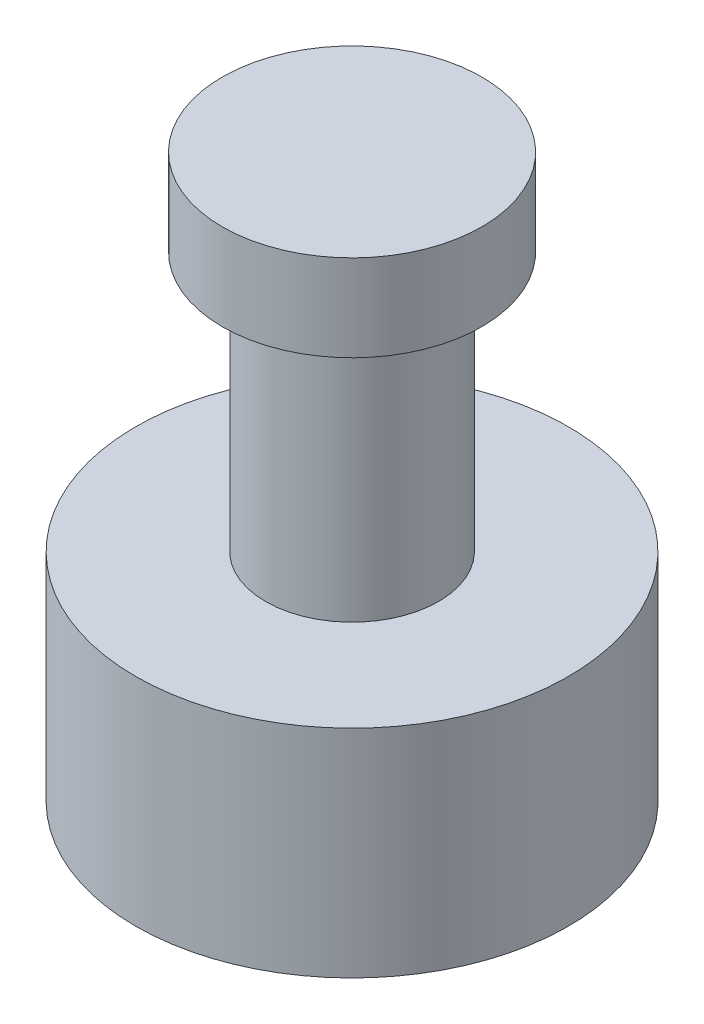
ISO-10303-21;
HEADER;
FILE_DESCRIPTION(('STEP AP214'),'2;1');
FILE_NAME('part.step','',(''),(''),'','','');
FILE_SCHEMA(('AUTOMOTIVE_DESIGN { 1 0 10303 214 1 1 1 1 }'));
ENDSEC;
DATA;
#1=APPLICATION_CONTEXT('core data for automotive mechanical design processes');
#2=APPLICATION_PROTOCOL_DEFINITION('international standard','automotive_design',2000,#1);
#3=PRODUCT_CONTEXT('',#1,'mechanical');
#4=PRODUCT('Part','Part','',(#3));
#5=PRODUCT_RELATED_PRODUCT_CATEGORY('part','',(#4));
#6=PRODUCT_DEFINITION_FORMATION('','',#4);
#7=PRODUCT_DEFINITION_CONTEXT('part definition',#1,'design');
#8=PRODUCT_DEFINITION('design','',#6,#7);
#9=PRODUCT_DEFINITION_SHAPE('','',#8);
#10=(LENGTH_UNIT() NAMED_UNIT(*) SI_UNIT(.MILLI.,.METRE.));
#11=(NAMED_UNIT(*) PLANE_ANGLE_UNIT() SI_UNIT($,.RADIAN.));
#12=(NAMED_UNIT(*) SI_UNIT($,.STERADIAN.) SOLID_ANGLE_UNIT());
#13=UNCERTAINTY_MEASURE_WITH_UNIT(LENGTH_MEASURE(1.E-05),#10,'distance_accuracy_value','');
#14=(GEOMETRIC_REPRESENTATION_CONTEXT(3) GLOBAL_UNCERTAINTY_ASSIGNED_CONTEXT((#13)) GLOBAL_UNIT_ASSIGNED_CONTEXT((#10,
#11,#12)) REPRESENTATION_CONTEXT('',''));
#15=CARTESIAN_POINT('',(0.,0.,0.));
#16=DIRECTION('',(0.,0.,1.));
#17=DIRECTION('',(1.,0.,0.));
#18=AXIS2_PLACEMENT_3D('',#15,#16,#17);
#19=CARTESIAN_POINT('',(0.,5.,0.));
#20=DIRECTION('',(0.,1.,0.));
#21=DIRECTION('',(0.,0.,1.));
#22=AXIS2_PLACEMENT_3D('',#19,#20,#21);
#23=PLANE('',#22);
#24=CARTESIAN_POINT('',(0.,5.,0.));
#25=DIRECTION('',(0.,1.,0.));
#26=DIRECTION('',(0.,0.,1.));
#27=AXIS2_PLACEMENT_3D('',#24,#25,#26);
#28=CIRCLE('',#27,5.);
#29=CARTESIAN_POINT('',(0.,5.,5.));
#30=VERTEX_POINT('',#29);
#31=EDGE_CURVE('E10',#30,#30,#28,.T.);
#32=ORIENTED_EDGE('',*,*,#31,.T.);
#33=EDGE_LOOP('',(#32));
#34=FACE_BOUND('',#33,.T.);
#35=CARTESIAN_POINT('',(0.,5.,0.));
#36=DIRECTION('',(0.,1.,0.));
#37=DIRECTION('',(0.,0.,1.));
#38=AXIS2_PLACEMENT_3D('',#35,#36,#37);
#39=CIRCLE('',#38,2.);
#40=CARTESIAN_POINT('',(0.,5.,2.));
#41=VERTEX_POINT('',#40);
#42=EDGE_CURVE('E30',#41,#41,#39,.T.);
#43=ORIENTED_EDGE('',*,*,#42,.F.);
#44=EDGE_LOOP('',(#43));
#45=FACE_BOUND('',#44,.T.);
#46=ADVANCED_FACE('F17',(#34,#45),#23,.T.);
#47=CARTESIAN_POINT('',(0.,5.,0.));
#48=DIRECTION('',(0.,-1.,0.));
#49=DIRECTION('',(0.,0.,-1.));
#50=AXIS2_PLACEMENT_3D('',#47,#48,#49);
#51=CYLINDRICAL_SURFACE('',#50,5.);
#52=ORIENTED_EDGE('',*,*,#31,.F.);
#53=EDGE_LOOP('',(#52));
#54=FACE_BOUND('',#53,.T.);
#55=CARTESIAN_POINT('',(0.,0.,0.));
#56=DIRECTION('',(0.,1.,0.));
#57=DIRECTION('',(0.,0.,1.));
#58=AXIS2_PLACEMENT_3D('',#55,#56,#57);
#59=CIRCLE('',#58,5.);
#60=CARTESIAN_POINT('',(0.,0.,5.));
#61=VERTEX_POINT('',#60);
#62=EDGE_CURVE('E21',#61,#61,#59,.T.);
#63=ORIENTED_EDGE('',*,*,#62,.T.);
#64=EDGE_LOOP('',(#63));
#65=FACE_BOUND('',#64,.T.);
#66=ADVANCED_FACE('F19',(#54,#65),#51,.T.);
#67=CARTESIAN_POINT('',(0.,0.,0.));
#68=DIRECTION('',(0.,1.,0.));
#69=DIRECTION('',(0.,0.,1.));
#70=AXIS2_PLACEMENT_3D('',#67,#68,#69);
#71=PLANE('',#70);
#72=ORIENTED_EDGE('',*,*,#62,.F.);
#73=EDGE_LOOP('',(#72));
#74=FACE_BOUND('',#73,.T.);
#75=ADVANCED_FACE('F59',(#74),#71,.F.);
#76=CARTESIAN_POINT('',(0.,11.,0.));
#77=DIRECTION('',(0.,-1.,0.));
#78=DIRECTION('',(0.,0.,-1.));
#79=AXIS2_PLACEMENT_3D('',#76,#77,#78);
#80=CYLINDRICAL_SURFACE('',#79,2.);
#81=CARTESIAN_POINT('',(0.,11.,0.));
#82=DIRECTION('',(0.,1.,0.));
#83=DIRECTION('',(0.,0.,1.));
#84=AXIS2_PLACEMENT_3D('',#81,#82,#83);
#85=CIRCLE('',#84,2.);
#86=CARTESIAN_POINT('',(0.,11.,2.));
#87=VERTEX_POINT('',#86);
#88=EDGE_CURVE('E28',#87,#87,#85,.T.);
#89=ORIENTED_EDGE('',*,*,#88,.F.);
#90=EDGE_LOOP('',(#89));
#91=FACE_BOUND('',#90,.T.);
#92=ORIENTED_EDGE('',*,*,#42,.T.);
#93=EDGE_LOOP('',(#92));
#94=FACE_BOUND('',#93,.T.);
#95=ADVANCED_FACE('F53',(#91,#94),#80,.T.);
#96=CARTESIAN_POINT('',(0.,11.,0.));
#97=DIRECTION('',(0.,1.,0.));
#98=DIRECTION('',(0.,0.,1.));
#99=AXIS2_PLACEMENT_3D('',#96,#97,#98);
#100=PLANE('',#99);
#101=CARTESIAN_POINT('',(0.,11.,0.));
#102=DIRECTION('',(0.,1.,0.));
#103=DIRECTION('',(0.,0.,1.));
#104=AXIS2_PLACEMENT_3D('',#101,#102,#103);
#105=CIRCLE('',#104,3.);
#106=CARTESIAN_POINT('',(0.,11.,3.));
#107=VERTEX_POINT('',#106);
#108=EDGE_CURVE('E36',#107,#107,#105,.T.);
#109=ORIENTED_EDGE('',*,*,#108,.F.);
#110=EDGE_LOOP('',(#109));
#111=FACE_BOUND('',#110,.T.);
#112=ORIENTED_EDGE('',*,*,#88,.T.);
#113=EDGE_LOOP('',(#112));
#114=FACE_BOUND('',#113,.T.);
#115=ADVANCED_FACE('F47',(#111,#114),#100,.F.);
#116=CARTESIAN_POINT('',(0.,13.,0.));
#117=DIRECTION('',(0.,-1.,0.));
#118=DIRECTION('',(0.,0.,-1.));
#119=AXIS2_PLACEMENT_3D('',#116,#117,#118);
#120=CYLINDRICAL_SURFACE('',#119,3.);
#121=CARTESIAN_POINT('',(0.,13.,0.));
#122=DIRECTION('',(0.,1.,0.));
#123=DIRECTION('',(0.,0.,1.));
#124=AXIS2_PLACEMENT_3D('',#121,#122,#123);
#125=CIRCLE('',#124,3.);
#126=CARTESIAN_POINT('',(0.,13.,3.));
#127=VERTEX_POINT('',#126);
#128=EDGE_CURVE('E33',#127,#127,#125,.T.);
#129=ORIENTED_EDGE('',*,*,#128,.F.);
#130=EDGE_LOOP('',(#129));
#131=FACE_BOUND('',#130,.T.);
#132=ORIENTED_EDGE('',*,*,#108,.T.);
#133=EDGE_LOOP('',(#132));
#134=FACE_BOUND('',#133,.T.);
#135=ADVANCED_FACE('F44',(#131,#134),#120,.T.);
#136=CARTESIAN_POINT('',(0.,13.,0.));
#137=DIRECTION('',(0.,1.,0.));
#138=DIRECTION('',(0.,0.,1.));
#139=AXIS2_PLACEMENT_3D('',#136,#137,#138);
#140=PLANE('',#139);
#141=ORIENTED_EDGE('',*,*,#128,.T.);
#142=EDGE_LOOP('',(#141));
#143=FACE_BOUND('',#142,.T.);
#144=ADVANCED_FACE('F42',(#143),#140,.T.);
#145=CLOSED_SHELL('',(#46,#66,#75,#95,#115,#135,#144));
#146=MANIFOLD_SOLID_BREP('B1',#145);
#147=ADVANCED_BREP_SHAPE_REPRESENTATION('',(#18,#146),#14);
#148=SHAPE_DEFINITION_REPRESENTATION(#9,#147);
ENDSEC;
END-ISO-10303-21;
